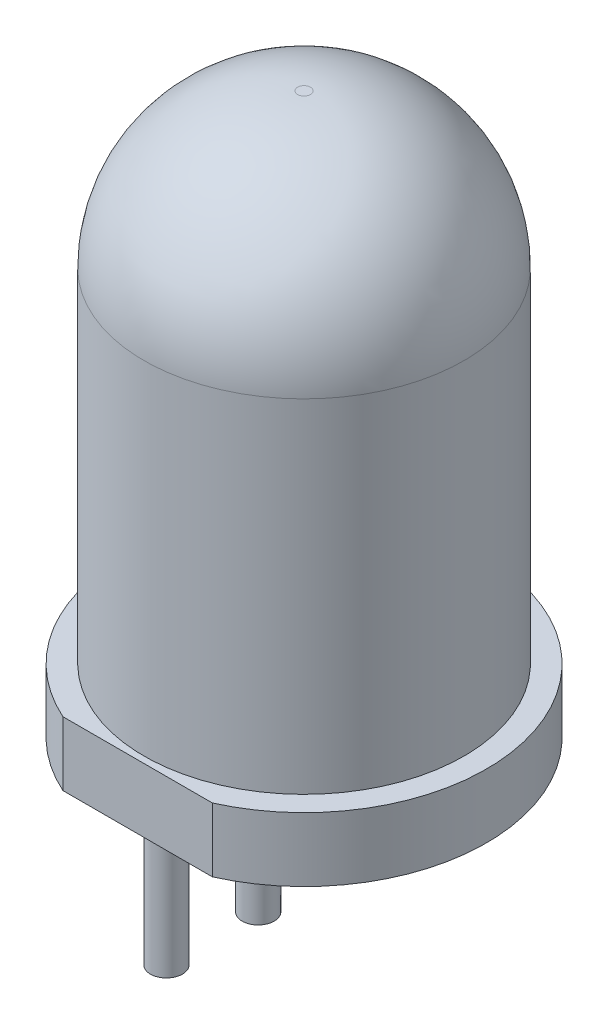
ISO-10303-21;
HEADER;
FILE_DESCRIPTION(('STEP AP214'),'2;1');
FILE_NAME('part.step','',(''),(''),'','','');
FILE_SCHEMA(('AUTOMOTIVE_DESIGN { 1 0 10303 214 1 1 1 1 }'));
ENDSEC;
DATA;
#1=APPLICATION_CONTEXT('core data for automotive mechanical design processes');
#2=APPLICATION_PROTOCOL_DEFINITION('international standard','automotive_design',2000,#1);
#3=PRODUCT_CONTEXT('',#1,'mechanical');
#4=PRODUCT('Part','Part','',(#3));
#5=PRODUCT_RELATED_PRODUCT_CATEGORY('part','',(#4));
#6=PRODUCT_DEFINITION_FORMATION('','',#4);
#7=PRODUCT_DEFINITION_CONTEXT('part definition',#1,'design');
#8=PRODUCT_DEFINITION('design','',#6,#7);
#9=PRODUCT_DEFINITION_SHAPE('','',#8);
#10=(LENGTH_UNIT() NAMED_UNIT(*) SI_UNIT(.MILLI.,.METRE.));
#11=(NAMED_UNIT(*) PLANE_ANGLE_UNIT() SI_UNIT($,.RADIAN.));
#12=(NAMED_UNIT(*) SI_UNIT($,.STERADIAN.) SOLID_ANGLE_UNIT());
#13=UNCERTAINTY_MEASURE_WITH_UNIT(LENGTH_MEASURE(1.E-05),#10,'distance_accuracy_value','');
#14=(GEOMETRIC_REPRESENTATION_CONTEXT(3) GLOBAL_UNCERTAINTY_ASSIGNED_CONTEXT((#13)) GLOBAL_UNIT_ASSIGNED_CONTEXT((#10,
#11,#12)) REPRESENTATION_CONTEXT('',''));
#15=CARTESIAN_POINT('',(0.,0.,0.));
#16=DIRECTION('',(0.,0.,1.));
#17=DIRECTION('',(1.,0.,0.));
#18=AXIS2_PLACEMENT_3D('',#15,#16,#17);
#19=CARTESIAN_POINT('',(0.,0.,0.));
#20=DIRECTION('',(0.,-1.,0.));
#21=DIRECTION('',(0.,0.,-1.));
#22=AXIS2_PLACEMENT_3D('',#19,#20,#21);
#23=PLANE('',#22);
#24=CARTESIAN_POINT('',(0.,0.,0.716666666666667));
#25=DIRECTION('',(0.,-1.,0.));
#26=DIRECTION('',(0.,0.,-1.));
#27=AXIS2_PLACEMENT_3D('',#24,#25,#26);
#28=CIRCLE('',#27,0.25);
#29=CARTESIAN_POINT('',(0.,0.,0.466666666666667));
#30=VERTEX_POINT('',#29);
#31=EDGE_CURVE('E102',#30,#30,#28,.T.);
#32=ORIENTED_EDGE('',*,*,#31,.F.);
#33=EDGE_LOOP('',(#32));
#34=FACE_BOUND('',#33,.T.);
#35=CARTESIAN_POINT('',(0.,0.,-0.716666666666667));
#36=DIRECTION('',(0.,-1.,0.));
#37=DIRECTION('',(0.,0.,-1.));
#38=AXIS2_PLACEMENT_3D('',#35,#36,#37);
#39=CIRCLE('',#38,0.25);
#40=CARTESIAN_POINT('',(0.,0.,-0.966666666666667));
#41=VERTEX_POINT('',#40);
#42=EDGE_CURVE('E96',#41,#41,#39,.T.);
#43=ORIENTED_EDGE('',*,*,#42,.F.);
#44=EDGE_LOOP('',(#43));
#45=FACE_BOUND('',#44,.T.);
#46=CARTESIAN_POINT('',(0.,0.,2.15));
#47=DIRECTION('',(0.,-1.,0.));
#48=DIRECTION('',(0.,0.,-1.));
#49=AXIS2_PLACEMENT_3D('',#46,#47,#48);
#50=CIRCLE('',#49,0.25);
#51=CARTESIAN_POINT('',(0.,0.,1.9));
#52=VERTEX_POINT('',#51);
#53=EDGE_CURVE('E90',#52,#52,#50,.T.);
#54=ORIENTED_EDGE('',*,*,#53,.F.);
#55=EDGE_LOOP('',(#54));
#56=FACE_BOUND('',#55,.T.);
#57=CARTESIAN_POINT('',(0.,0.,-2.15));
#58=DIRECTION('',(0.,-1.,0.));
#59=DIRECTION('',(0.,0.,-1.));
#60=AXIS2_PLACEMENT_3D('',#57,#58,#59);
#61=CIRCLE('',#60,0.25);
#62=CARTESIAN_POINT('',(0.,0.,-2.4));
#63=VERTEX_POINT('',#62);
#64=EDGE_CURVE('E84',#63,#63,#61,.T.);
#65=ORIENTED_EDGE('',*,*,#64,.F.);
#66=EDGE_LOOP('',(#65));
#67=FACE_BOUND('',#66,.T.);
#68=DIRECTION('',(1.,0.,0.));
#69=VECTOR('',#68,1.);
#70=CARTESIAN_POINT('',(-1.16726175299288,0.,2.6));
#71=LINE('',#70,#69);
#72=CARTESIAN_POINT('',(-1.16726175299288,0.,2.6));
#73=VERTEX_POINT('',#72);
#74=CARTESIAN_POINT('',(1.16726175299288,0.,2.6));
#75=VERTEX_POINT('',#74);
#76=EDGE_CURVE('E63',#73,#75,#71,.T.);
#77=ORIENTED_EDGE('',*,*,#76,.F.);
#78=CARTESIAN_POINT('',(0.,0.,0.));
#79=DIRECTION('',(0.,-1.,0.));
#80=DIRECTION('',(0.,0.,-1.));
#81=AXIS2_PLACEMENT_3D('',#78,#79,#80);
#82=CIRCLE('',#81,2.85);
#83=EDGE_CURVE('E11',#73,#75,#82,.T.);
#84=ORIENTED_EDGE('',*,*,#83,.T.);
#85=EDGE_LOOP('',(#77,#84));
#86=FACE_BOUND('',#85,.T.);
#87=ADVANCED_FACE('F34',(#34,#45,#56,#67,#86),#23,.T.);
#88=CARTESIAN_POINT('',(0.,0.,0.));
#89=DIRECTION('',(0.,-1.,0.));
#90=DIRECTION('',(0.,0.,-1.));
#91=AXIS2_PLACEMENT_3D('',#88,#89,#90);
#92=CYLINDRICAL_SURFACE('',#91,2.85);
#93=DIRECTION('',(0.,-1.,0.));
#94=VECTOR('',#93,1.);
#95=CARTESIAN_POINT('',(1.16726175299288,3.34787137637478,2.6));
#96=LINE('',#95,#94);
#97=CARTESIAN_POINT('',(1.16726175299288,1.,2.6));
#98=VERTEX_POINT('',#97);
#99=EDGE_CURVE('E48',#98,#75,#96,.T.);
#100=ORIENTED_EDGE('',*,*,#99,.T.);
#101=ORIENTED_EDGE('',*,*,#83,.F.);
#102=DIRECTION('',(0.,-1.,0.));
#103=VECTOR('',#102,1.);
#104=CARTESIAN_POINT('',(-1.16726175299288,3.34787137637478,2.6));
#105=LINE('',#104,#103);
#106=CARTESIAN_POINT('',(-1.16726175299288,1.,2.6));
#107=VERTEX_POINT('',#106);
#108=EDGE_CURVE('E54',#107,#73,#105,.T.);
#109=ORIENTED_EDGE('',*,*,#108,.F.);
#110=CARTESIAN_POINT('',(0.,1.,0.));
#111=DIRECTION('',(0.,-1.,0.));
#112=DIRECTION('',(0.,0.,-1.));
#113=AXIS2_PLACEMENT_3D('',#110,#111,#112);
#114=CIRCLE('',#113,2.85);
#115=EDGE_CURVE('E41',#107,#98,#114,.T.);
#116=ORIENTED_EDGE('',*,*,#115,.T.);
#117=EDGE_LOOP('',(#100,#101,#109,#116));
#118=FACE_BOUND('',#117,.T.);
#119=ADVANCED_FACE('F67',(#118),#92,.T.);
#120=CARTESIAN_POINT('',(2.85,1.,0.));
#121=DIRECTION('',(0.,1.,0.));
#122=DIRECTION('',(0.,0.,1.));
#123=AXIS2_PLACEMENT_3D('',#120,#121,#122);
#124=PLANE('',#123);
#125=DIRECTION('',(1.,0.,0.));
#126=VECTOR('',#125,1.);
#127=CARTESIAN_POINT('',(-1.16726175299288,1.,2.6));
#128=LINE('',#127,#126);
#129=EDGE_CURVE('E58',#107,#98,#128,.T.);
#130=ORIENTED_EDGE('',*,*,#129,.T.);
#131=ORIENTED_EDGE('',*,*,#115,.F.);
#132=EDGE_LOOP('',(#130,#131));
#133=FACE_BOUND('',#132,.T.);
#134=CARTESIAN_POINT('',(0.,1.,0.));
#135=DIRECTION('',(0.,-1.,0.));
#136=DIRECTION('',(0.,0.,-1.));
#137=AXIS2_PLACEMENT_3D('',#134,#135,#136);
#138=CIRCLE('',#137,2.5);
#139=CARTESIAN_POINT('',(0.,1.,-2.5));
#140=VERTEX_POINT('',#139);
#141=EDGE_CURVE('E72',#140,#140,#138,.T.);
#142=ORIENTED_EDGE('',*,*,#141,.T.);
#143=EDGE_LOOP('',(#142));
#144=FACE_BOUND('',#143,.T.);
#145=ADVANCED_FACE('F70',(#133,#144),#124,.T.);
#146=CARTESIAN_POINT('',(0.,0.,0.));
#147=DIRECTION('',(0.,-1.,0.));
#148=DIRECTION('',(0.,0.,-1.));
#149=AXIS2_PLACEMENT_3D('',#146,#147,#148);
#150=CYLINDRICAL_SURFACE('',#149,2.5);
#151=CARTESIAN_POINT('',(0.,6.35,0.));
#152=DIRECTION('',(0.,-1.,0.));
#153=DIRECTION('',(0.,0.,-1.));
#154=AXIS2_PLACEMENT_3D('',#151,#152,#153);
#155=CIRCLE('',#154,2.5);
#156=CARTESIAN_POINT('',(0.,6.35,-2.5));
#157=VERTEX_POINT('',#156);
#158=EDGE_CURVE('E74',#157,#157,#155,.T.);
#159=ORIENTED_EDGE('',*,*,#158,.T.);
#160=EDGE_LOOP('',(#159));
#161=FACE_BOUND('',#160,.T.);
#162=ORIENTED_EDGE('',*,*,#141,.F.);
#163=EDGE_LOOP('',(#162));
#164=FACE_BOUND('',#163,.T.);
#165=ADVANCED_FACE('F149',(#161,#164),#150,.T.);
#166=CARTESIAN_POINT('',(0.,6.35,0.));
#167=DIRECTION('',(0.,-1.,0.));
#168=DIRECTION('',(0.,0.,-1.));
#169=AXIS2_PLACEMENT_3D('',#166,#167,#168);
#170=DEGENERATE_TOROIDAL_SURFACE('',#169,0.1,2.4,.T.);
#171=CARTESIAN_POINT('',(0.,8.75,0.));
#172=DIRECTION('',(0.,-1.,0.));
#173=DIRECTION('',(0.,0.,-1.));
#174=AXIS2_PLACEMENT_3D('',#171,#172,#173);
#175=CIRCLE('',#174,0.1);
#176=CARTESIAN_POINT('',(0.,8.75,-0.1));
#177=VERTEX_POINT('',#176);
#178=EDGE_CURVE('E68',#177,#177,#175,.T.);
#179=ORIENTED_EDGE('',*,*,#178,.T.);
#180=EDGE_LOOP('',(#179));
#181=FACE_BOUND('',#180,.T.);
#182=ORIENTED_EDGE('',*,*,#158,.F.);
#183=EDGE_LOOP('',(#182));
#184=FACE_BOUND('',#183,.T.);
#185=ADVANCED_FACE('F145',(#181,#184),#170,.T.);
#186=CARTESIAN_POINT('',(0.,8.75,0.));
#187=DIRECTION('',(0.,1.,0.));
#188=DIRECTION('',(0.,0.,1.));
#189=AXIS2_PLACEMENT_3D('',#186,#187,#188);
#190=PLANE('',#189);
#191=ORIENTED_EDGE('',*,*,#178,.F.);
#192=EDGE_LOOP('',(#191));
#193=FACE_BOUND('',#192,.T.);
#194=ADVANCED_FACE('F138',(#193),#190,.T.);
#195=CARTESIAN_POINT('',(-1.16726175299288,3.34787137637478,2.6));
#196=DIRECTION('',(0.,0.,-1.));
#197=DIRECTION('',(-1.,0.,0.));
#198=AXIS2_PLACEMENT_3D('',#195,#196,#197);
#199=PLANE('',#198);
#200=ORIENTED_EDGE('',*,*,#108,.T.);
#201=ORIENTED_EDGE('',*,*,#76,.T.);
#202=ORIENTED_EDGE('',*,*,#99,.F.);
#203=ORIENTED_EDGE('',*,*,#129,.F.);
#204=EDGE_LOOP('',(#200,#201,#202,#203));
#205=FACE_BOUND('',#204,.T.);
#206=ADVANCED_FACE('F59',(#205),#199,.F.);
#207=CARTESIAN_POINT('',(0.,-2.,-2.15));
#208=DIRECTION('',(0.,1.,0.));
#209=DIRECTION('',(0.,0.,1.));
#210=AXIS2_PLACEMENT_3D('',#207,#208,#209);
#211=CYLINDRICAL_SURFACE('',#210,0.25);
#212=CARTESIAN_POINT('',(0.,-2.,-2.15));
#213=DIRECTION('',(0.,-1.,0.));
#214=DIRECTION('',(0.,0.,-1.));
#215=AXIS2_PLACEMENT_3D('',#212,#213,#214);
#216=CIRCLE('',#215,0.25);
#217=CARTESIAN_POINT('',(0.,-2.,-2.4));
#218=VERTEX_POINT('',#217);
#219=EDGE_CURVE('E83',#218,#218,#216,.T.);
#220=ORIENTED_EDGE('',*,*,#219,.F.);
#221=EDGE_LOOP('',(#220));
#222=FACE_BOUND('',#221,.T.);
#223=ORIENTED_EDGE('',*,*,#64,.T.);
#224=EDGE_LOOP('',(#223));
#225=FACE_BOUND('',#224,.T.);
#226=ADVANCED_FACE('F126',(#222,#225),#211,.T.);
#227=CARTESIAN_POINT('',(0.,-2.,-2.15));
#228=DIRECTION('',(0.,-1.,0.));
#229=DIRECTION('',(0.,0.,-1.));
#230=AXIS2_PLACEMENT_3D('',#227,#228,#229);
#231=PLANE('',#230);
#232=ORIENTED_EDGE('',*,*,#219,.T.);
#233=EDGE_LOOP('',(#232));
#234=FACE_BOUND('',#233,.T.);
#235=ADVANCED_FACE('F128',(#234),#231,.T.);
#236=CARTESIAN_POINT('',(0.,-2.,2.15));
#237=DIRECTION('',(0.,1.,0.));
#238=DIRECTION('',(0.,0.,1.));
#239=AXIS2_PLACEMENT_3D('',#236,#237,#238);
#240=CYLINDRICAL_SURFACE('',#239,0.25);
#241=CARTESIAN_POINT('',(0.,-2.,2.15));
#242=DIRECTION('',(0.,-1.,0.));
#243=DIRECTION('',(0.,0.,-1.));
#244=AXIS2_PLACEMENT_3D('',#241,#242,#243);
#245=CIRCLE('',#244,0.25);
#246=CARTESIAN_POINT('',(0.,-2.,1.9));
#247=VERTEX_POINT('',#246);
#248=EDGE_CURVE('E87',#247,#247,#245,.T.);
#249=ORIENTED_EDGE('',*,*,#248,.F.);
#250=EDGE_LOOP('',(#249));
#251=FACE_BOUND('',#250,.T.);
#252=ORIENTED_EDGE('',*,*,#53,.T.);
#253=EDGE_LOOP('',(#252));
#254=FACE_BOUND('',#253,.T.);
#255=ADVANCED_FACE('F135',(#251,#254),#240,.T.);
#256=CARTESIAN_POINT('',(0.,-2.,2.15));
#257=DIRECTION('',(0.,-1.,0.));
#258=DIRECTION('',(0.,0.,-1.));
#259=AXIS2_PLACEMENT_3D('',#256,#257,#258);
#260=PLANE('',#259);
#261=ORIENTED_EDGE('',*,*,#248,.T.);
#262=EDGE_LOOP('',(#261));
#263=FACE_BOUND('',#262,.T.);
#264=ADVANCED_FACE('F203',(#263),#260,.T.);
#265=CARTESIAN_POINT('',(0.,-2.,-0.716666666666667));
#266=DIRECTION('',(0.,1.,0.));
#267=DIRECTION('',(0.,0.,1.));
#268=AXIS2_PLACEMENT_3D('',#265,#266,#267);
#269=CYLINDRICAL_SURFACE('',#268,0.25);
#270=CARTESIAN_POINT('',(0.,-2.,-0.716666666666667));
#271=DIRECTION('',(0.,-1.,0.));
#272=DIRECTION('',(0.,0.,-1.));
#273=AXIS2_PLACEMENT_3D('',#270,#271,#272);
#274=CIRCLE('',#273,0.25);
#275=CARTESIAN_POINT('',(0.,-2.,-0.966666666666667));
#276=VERTEX_POINT('',#275);
#277=EDGE_CURVE('E93',#276,#276,#274,.T.);
#278=ORIENTED_EDGE('',*,*,#277,.F.);
#279=EDGE_LOOP('',(#278));
#280=FACE_BOUND('',#279,.T.);
#281=ORIENTED_EDGE('',*,*,#42,.T.);
#282=EDGE_LOOP('',(#281));
#283=FACE_BOUND('',#282,.T.);
#284=ADVANCED_FACE('F212',(#280,#283),#269,.T.);
#285=CARTESIAN_POINT('',(0.,-2.,-0.716666666666667));
#286=DIRECTION('',(0.,-1.,0.));
#287=DIRECTION('',(0.,0.,-1.));
#288=AXIS2_PLACEMENT_3D('',#285,#286,#287);
#289=PLANE('',#288);
#290=ORIENTED_EDGE('',*,*,#277,.T.);
#291=EDGE_LOOP('',(#290));
#292=FACE_BOUND('',#291,.T.);
#293=ADVANCED_FACE('F113',(#292),#289,.T.);
#294=CARTESIAN_POINT('',(0.,-2.,0.716666666666667));
#295=DIRECTION('',(0.,1.,0.));
#296=DIRECTION('',(0.,0.,1.));
#297=AXIS2_PLACEMENT_3D('',#294,#295,#296);
#298=CYLINDRICAL_SURFACE('',#297,0.25);
#299=CARTESIAN_POINT('',(0.,-2.,0.716666666666667));
#300=DIRECTION('',(0.,-1.,0.));
#301=DIRECTION('',(0.,0.,-1.));
#302=AXIS2_PLACEMENT_3D('',#299,#300,#301);
#303=CIRCLE('',#302,0.25);
#304=CARTESIAN_POINT('',(0.,-2.,0.466666666666667));
#305=VERTEX_POINT('',#304);
#306=EDGE_CURVE('E99',#305,#305,#303,.T.);
#307=ORIENTED_EDGE('',*,*,#306,.F.);
#308=EDGE_LOOP('',(#307));
#309=FACE_BOUND('',#308,.T.);
#310=ORIENTED_EDGE('',*,*,#31,.T.);
#311=EDGE_LOOP('',(#310));
#312=FACE_BOUND('',#311,.T.);
#313=ADVANCED_FACE('F110',(#309,#312),#298,.T.);
#314=CARTESIAN_POINT('',(0.,-2.,0.716666666666667));
#315=DIRECTION('',(0.,-1.,0.));
#316=DIRECTION('',(0.,0.,-1.));
#317=AXIS2_PLACEMENT_3D('',#314,#315,#316);
#318=PLANE('',#317);
#319=ORIENTED_EDGE('',*,*,#306,.T.);
#320=EDGE_LOOP('',(#319));
#321=FACE_BOUND('',#320,.T.);
#322=ADVANCED_FACE('F108',(#321),#318,.T.);
#323=CLOSED_SHELL('',(#87,#119,#145,#165,#185,#194,#206,#226,#235,#255,#264,#284,#293,#313,#322));
#324=MANIFOLD_SOLID_BREP('B2',#323);
#325=ADVANCED_BREP_SHAPE_REPRESENTATION('',(#18,#324),#14);
#326=SHAPE_DEFINITION_REPRESENTATION(#9,#325);
ENDSEC;
END-ISO-10303-21;
